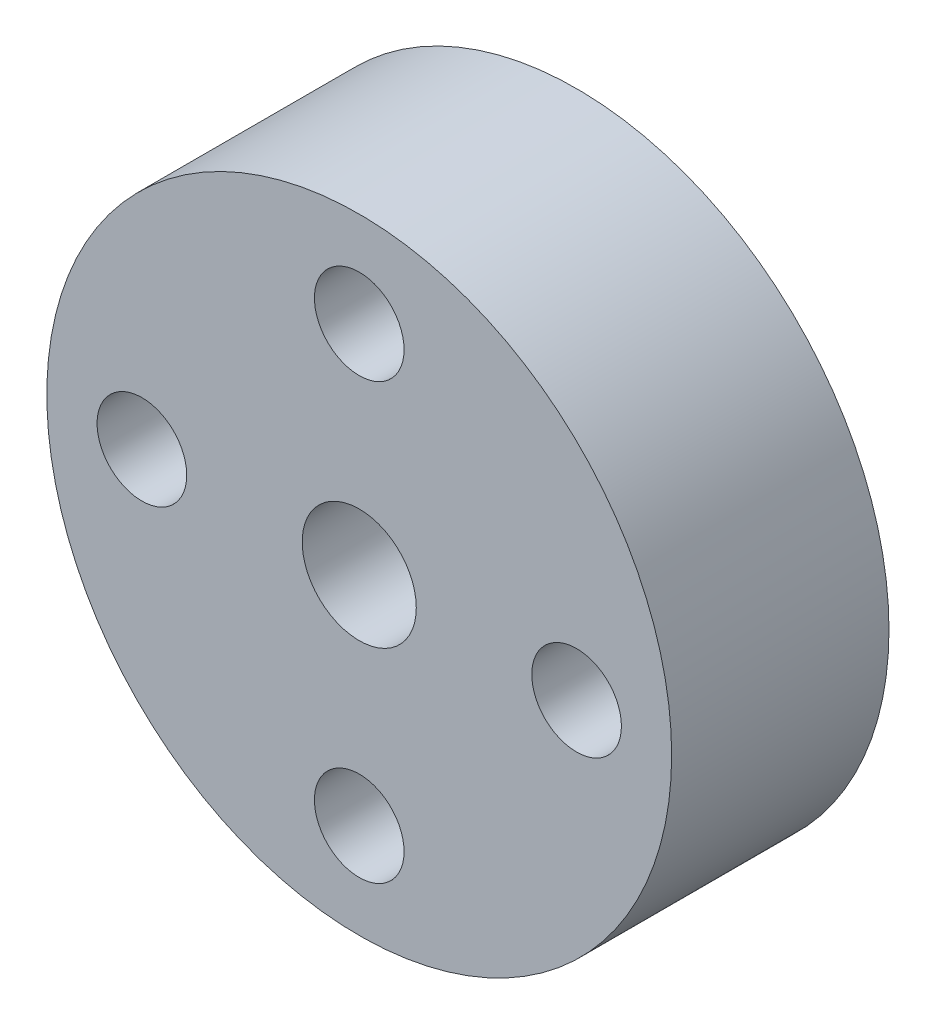
ISO-10303-21;
HEADER;
FILE_DESCRIPTION(('STEP AP214'),'2;1');
FILE_NAME('part.step','',(''),(''),'','','');
FILE_SCHEMA(('AUTOMOTIVE_DESIGN { 1 0 10303 214 1 1 1 1 }'));
ENDSEC;
DATA;
#1=APPLICATION_CONTEXT('core data for automotive mechanical design processes');
#2=APPLICATION_PROTOCOL_DEFINITION('international standard','automotive_design',2000,#1);
#3=PRODUCT_CONTEXT('',#1,'mechanical');
#4=PRODUCT('Part','Part','',(#3));
#5=PRODUCT_RELATED_PRODUCT_CATEGORY('part','',(#4));
#6=PRODUCT_DEFINITION_FORMATION('','',#4);
#7=PRODUCT_DEFINITION_CONTEXT('part definition',#1,'design');
#8=PRODUCT_DEFINITION('design','',#6,#7);
#9=PRODUCT_DEFINITION_SHAPE('','',#8);
#10=(LENGTH_UNIT() NAMED_UNIT(*) SI_UNIT(.MILLI.,.METRE.));
#11=(NAMED_UNIT(*) PLANE_ANGLE_UNIT() SI_UNIT($,.RADIAN.));
#12=(NAMED_UNIT(*) SI_UNIT($,.STERADIAN.) SOLID_ANGLE_UNIT());
#13=UNCERTAINTY_MEASURE_WITH_UNIT(LENGTH_MEASURE(1.E-05),#10,'distance_accuracy_value','');
#14=(GEOMETRIC_REPRESENTATION_CONTEXT(3) GLOBAL_UNCERTAINTY_ASSIGNED_CONTEXT((#13)) GLOBAL_UNIT_ASSIGNED_CONTEXT((#10,
#11,#12)) REPRESENTATION_CONTEXT('',''));
#15=CARTESIAN_POINT('',(0.,0.,0.));
#16=DIRECTION('',(0.,0.,1.));
#17=DIRECTION('',(1.,0.,0.));
#18=AXIS2_PLACEMENT_3D('',#15,#16,#17);
#19=CARTESIAN_POINT('',(0.,0.,8.));
#20=DIRECTION('',(0.,0.,1.));
#21=DIRECTION('',(1.,0.,0.));
#22=AXIS2_PLACEMENT_3D('',#19,#20,#21);
#23=PLANE('',#22);
#24=CARTESIAN_POINT('',(2.29241571302247E-13,-7.99999999999977,8.));
#25=DIRECTION('',(0.,0.,1.));
#26=DIRECTION('',(1.,0.,0.));
#27=AXIS2_PLACEMENT_3D('',#24,#25,#26);
#28=CIRCLE('',#27,1.65000000000034);
#29=CARTESIAN_POINT('',(1.65000000000057,-7.99999999999977,8.));
#30=VERTEX_POINT('',#29);
#31=EDGE_CURVE('E59',#30,#30,#28,.T.);
#32=ORIENTED_EDGE('',*,*,#31,.F.);
#33=EDGE_LOOP('',(#32));
#34=FACE_BOUND('',#33,.T.);
#35=CARTESIAN_POINT('',(0.,0.,8.));
#36=DIRECTION('',(0.,0.,1.));
#37=DIRECTION('',(1.,0.,0.));
#38=AXIS2_PLACEMENT_3D('',#35,#36,#37);
#39=CIRCLE('',#38,2.1);
#40=CARTESIAN_POINT('',(2.1,0.,8.));
#41=VERTEX_POINT('',#40);
#42=EDGE_CURVE('E47',#41,#41,#39,.T.);
#43=ORIENTED_EDGE('',*,*,#42,.F.);
#44=EDGE_LOOP('',(#43));
#45=FACE_BOUND('',#44,.T.);
#46=CARTESIAN_POINT('',(0.,0.,8.));
#47=DIRECTION('',(0.,0.,1.));
#48=DIRECTION('',(1.,0.,0.));
#49=AXIS2_PLACEMENT_3D('',#46,#47,#48);
#50=CIRCLE('',#49,11.5);
#51=CARTESIAN_POINT('',(11.5,0.,8.));
#52=VERTEX_POINT('',#51);
#53=EDGE_CURVE('E10',#52,#52,#50,.T.);
#54=ORIENTED_EDGE('',*,*,#53,.T.);
#55=EDGE_LOOP('',(#54));
#56=FACE_BOUND('',#55,.T.);
#57=CARTESIAN_POINT('',(0.,8.,8.));
#58=DIRECTION('',(0.,0.,1.));
#59=DIRECTION('',(1.,0.,0.));
#60=AXIS2_PLACEMENT_3D('',#57,#58,#59);
#61=CIRCLE('',#60,1.65);
#62=CARTESIAN_POINT('',(1.65,8.,8.));
#63=VERTEX_POINT('',#62);
#64=EDGE_CURVE('E42',#63,#63,#61,.T.);
#65=ORIENTED_EDGE('',*,*,#64,.F.);
#66=EDGE_LOOP('',(#65));
#67=FACE_BOUND('',#66,.T.);
#68=CARTESIAN_POINT('',(8.00000000000023,2.25904099284255E-13,8.));
#69=DIRECTION('',(0.,0.,1.));
#70=DIRECTION('',(1.,0.,0.));
#71=AXIS2_PLACEMENT_3D('',#68,#69,#70);
#72=CIRCLE('',#71,1.65000000000018);
#73=CARTESIAN_POINT('',(9.6500000000004,2.25904099284255E-13,8.));
#74=VERTEX_POINT('',#73);
#75=EDGE_CURVE('E53',#74,#74,#72,.T.);
#76=ORIENTED_EDGE('',*,*,#75,.F.);
#77=EDGE_LOOP('',(#76));
#78=FACE_BOUND('',#77,.T.);
#79=CARTESIAN_POINT('',(-7.99999999999977,-2.26883816723573E-13,8.));
#80=DIRECTION('',(0.,0.,1.));
#81=DIRECTION('',(1.,0.,0.));
#82=AXIS2_PLACEMENT_3D('',#79,#80,#81);
#83=CIRCLE('',#82,1.65000000000036);
#84=CARTESIAN_POINT('',(-6.34999999999941,-2.26883816723573E-13,8.));
#85=VERTEX_POINT('',#84);
#86=EDGE_CURVE('E65',#85,#85,#83,.T.);
#87=ORIENTED_EDGE('',*,*,#86,.F.);
#88=EDGE_LOOP('',(#87));
#89=FACE_BOUND('',#88,.T.);
#90=ADVANCED_FACE('F31',(#34,#45,#56,#67,#78,#89),#23,.T.);
#91=CARTESIAN_POINT('',(0.,0.,0.));
#92=DIRECTION('',(0.,0.,1.));
#93=DIRECTION('',(1.,0.,0.));
#94=AXIS2_PLACEMENT_3D('',#91,#92,#93);
#95=PLANE('',#94);
#96=CARTESIAN_POINT('',(0.,0.,0.));
#97=DIRECTION('',(0.,0.,1.));
#98=DIRECTION('',(1.,0.,0.));
#99=AXIS2_PLACEMENT_3D('',#96,#97,#98);
#100=CIRCLE('',#99,11.5);
#101=CARTESIAN_POINT('',(11.5,0.,0.));
#102=VERTEX_POINT('',#101);
#103=EDGE_CURVE('E35',#102,#102,#100,.T.);
#104=ORIENTED_EDGE('',*,*,#103,.F.);
#105=EDGE_LOOP('',(#104));
#106=FACE_BOUND('',#105,.T.);
#107=CARTESIAN_POINT('',(0.,8.,0.));
#108=DIRECTION('',(0.,0.,1.));
#109=DIRECTION('',(1.,0.,0.));
#110=AXIS2_PLACEMENT_3D('',#107,#108,#109);
#111=CIRCLE('',#110,1.65);
#112=CARTESIAN_POINT('',(1.65,8.,0.));
#113=VERTEX_POINT('',#112);
#114=EDGE_CURVE('E44',#113,#113,#111,.T.);
#115=ORIENTED_EDGE('',*,*,#114,.T.);
#116=EDGE_LOOP('',(#115));
#117=FACE_BOUND('',#116,.T.);
#118=CARTESIAN_POINT('',(0.,0.,0.));
#119=DIRECTION('',(0.,0.,1.));
#120=DIRECTION('',(1.,0.,0.));
#121=AXIS2_PLACEMENT_3D('',#118,#119,#120);
#122=CIRCLE('',#121,2.1);
#123=CARTESIAN_POINT('',(2.1,0.,0.));
#124=VERTEX_POINT('',#123);
#125=EDGE_CURVE('E50',#124,#124,#122,.T.);
#126=ORIENTED_EDGE('',*,*,#125,.T.);
#127=EDGE_LOOP('',(#126));
#128=FACE_BOUND('',#127,.T.);
#129=CARTESIAN_POINT('',(8.00000000000023,2.25904099284255E-13,0.));
#130=DIRECTION('',(0.,0.,1.));
#131=DIRECTION('',(1.,0.,0.));
#132=AXIS2_PLACEMENT_3D('',#129,#130,#131);
#133=CIRCLE('',#132,1.65000000000018);
#134=CARTESIAN_POINT('',(9.6500000000004,2.25904099284255E-13,0.));
#135=VERTEX_POINT('',#134);
#136=EDGE_CURVE('E56',#135,#135,#133,.T.);
#137=ORIENTED_EDGE('',*,*,#136,.T.);
#138=EDGE_LOOP('',(#137));
#139=FACE_BOUND('',#138,.T.);
#140=CARTESIAN_POINT('',(2.29241571302247E-13,-7.99999999999977,0.));
#141=DIRECTION('',(0.,0.,1.));
#142=DIRECTION('',(1.,0.,0.));
#143=AXIS2_PLACEMENT_3D('',#140,#141,#142);
#144=CIRCLE('',#143,1.65000000000034);
#145=CARTESIAN_POINT('',(1.65000000000057,-7.99999999999977,0.));
#146=VERTEX_POINT('',#145);
#147=EDGE_CURVE('E62',#146,#146,#144,.T.);
#148=ORIENTED_EDGE('',*,*,#147,.T.);
#149=EDGE_LOOP('',(#148));
#150=FACE_BOUND('',#149,.T.);
#151=CARTESIAN_POINT('',(-7.99999999999977,-2.26883816723573E-13,0.));
#152=DIRECTION('',(0.,0.,1.));
#153=DIRECTION('',(1.,0.,0.));
#154=AXIS2_PLACEMENT_3D('',#151,#152,#153);
#155=CIRCLE('',#154,1.65000000000036);
#156=CARTESIAN_POINT('',(-6.34999999999941,-2.26883816723573E-13,0.));
#157=VERTEX_POINT('',#156);
#158=EDGE_CURVE('E68',#157,#157,#155,.T.);
#159=ORIENTED_EDGE('',*,*,#158,.T.);
#160=EDGE_LOOP('',(#159));
#161=FACE_BOUND('',#160,.T.);
#162=ADVANCED_FACE('F78',(#106,#117,#128,#139,#150,#161),#95,.F.);
#163=CARTESIAN_POINT('',(0.,0.,8.));
#164=DIRECTION('',(0.,0.,-1.));
#165=DIRECTION('',(-1.,0.,0.));
#166=AXIS2_PLACEMENT_3D('',#163,#164,#165);
#167=CYLINDRICAL_SURFACE('',#166,11.5);
#168=ORIENTED_EDGE('',*,*,#53,.F.);
#169=EDGE_LOOP('',(#168));
#170=FACE_BOUND('',#169,.T.);
#171=ORIENTED_EDGE('',*,*,#103,.T.);
#172=EDGE_LOOP('',(#171));
#173=FACE_BOUND('',#172,.T.);
#174=ADVANCED_FACE('F33',(#170,#173),#167,.T.);
#175=CARTESIAN_POINT('',(0.,8.,8.));
#176=DIRECTION('',(0.,0.,-1.));
#177=DIRECTION('',(-1.,0.,0.));
#178=AXIS2_PLACEMENT_3D('',#175,#176,#177);
#179=CYLINDRICAL_SURFACE('',#178,1.65);
#180=ORIENTED_EDGE('',*,*,#64,.T.);
#181=EDGE_LOOP('',(#180));
#182=FACE_BOUND('',#181,.T.);
#183=ORIENTED_EDGE('',*,*,#114,.F.);
#184=EDGE_LOOP('',(#183));
#185=FACE_BOUND('',#184,.T.);
#186=ADVANCED_FACE('F88',(#182,#185),#179,.F.);
#187=CARTESIAN_POINT('',(0.,0.,8.));
#188=DIRECTION('',(0.,0.,-1.));
#189=DIRECTION('',(-1.,0.,0.));
#190=AXIS2_PLACEMENT_3D('',#187,#188,#189);
#191=CYLINDRICAL_SURFACE('',#190,2.1);
#192=ORIENTED_EDGE('',*,*,#42,.T.);
#193=EDGE_LOOP('',(#192));
#194=FACE_BOUND('',#193,.T.);
#195=ORIENTED_EDGE('',*,*,#125,.F.);
#196=EDGE_LOOP('',(#195));
#197=FACE_BOUND('',#196,.T.);
#198=ADVANCED_FACE('F91',(#194,#197),#191,.F.);
#199=CARTESIAN_POINT('',(8.00000000000023,2.25904099284255E-13,8.));
#200=DIRECTION('',(0.,0.,-1.));
#201=DIRECTION('',(-1.,0.,0.));
#202=AXIS2_PLACEMENT_3D('',#199,#200,#201);
#203=CYLINDRICAL_SURFACE('',#202,1.65000000000018);
#204=ORIENTED_EDGE('',*,*,#75,.T.);
#205=EDGE_LOOP('',(#204));
#206=FACE_BOUND('',#205,.T.);
#207=ORIENTED_EDGE('',*,*,#136,.F.);
#208=EDGE_LOOP('',(#207));
#209=FACE_BOUND('',#208,.T.);
#210=ADVANCED_FACE('F95',(#206,#209),#203,.F.);
#211=CARTESIAN_POINT('',(2.29241571302247E-13,-7.99999999999977,8.));
#212=DIRECTION('',(0.,0.,-1.));
#213=DIRECTION('',(-1.,0.,0.));
#214=AXIS2_PLACEMENT_3D('',#211,#212,#213);
#215=CYLINDRICAL_SURFACE('',#214,1.65000000000034);
#216=ORIENTED_EDGE('',*,*,#31,.T.);
#217=EDGE_LOOP('',(#216));
#218=FACE_BOUND('',#217,.T.);
#219=ORIENTED_EDGE('',*,*,#147,.F.);
#220=EDGE_LOOP('',(#219));
#221=FACE_BOUND('',#220,.T.);
#222=ADVANCED_FACE('F99',(#218,#221),#215,.F.);
#223=CARTESIAN_POINT('',(-7.99999999999977,-2.26883816723573E-13,8.));
#224=DIRECTION('',(0.,0.,-1.));
#225=DIRECTION('',(-1.,0.,0.));
#226=AXIS2_PLACEMENT_3D('',#223,#224,#225);
#227=CYLINDRICAL_SURFACE('',#226,1.65000000000036);
#228=ORIENTED_EDGE('',*,*,#86,.T.);
#229=EDGE_LOOP('',(#228));
#230=FACE_BOUND('',#229,.T.);
#231=ORIENTED_EDGE('',*,*,#158,.F.);
#232=EDGE_LOOP('',(#231));
#233=FACE_BOUND('',#232,.T.);
#234=ADVANCED_FACE('F74',(#230,#233),#227,.F.);
#235=CLOSED_SHELL('',(#90,#162,#174,#186,#198,#210,#222,#234));
#236=MANIFOLD_SOLID_BREP('B2',#235);
#237=ADVANCED_BREP_SHAPE_REPRESENTATION('',(#18,#236),#14);
#238=SHAPE_DEFINITION_REPRESENTATION(#9,#237);
ENDSEC;
END-ISO-10303-21;
